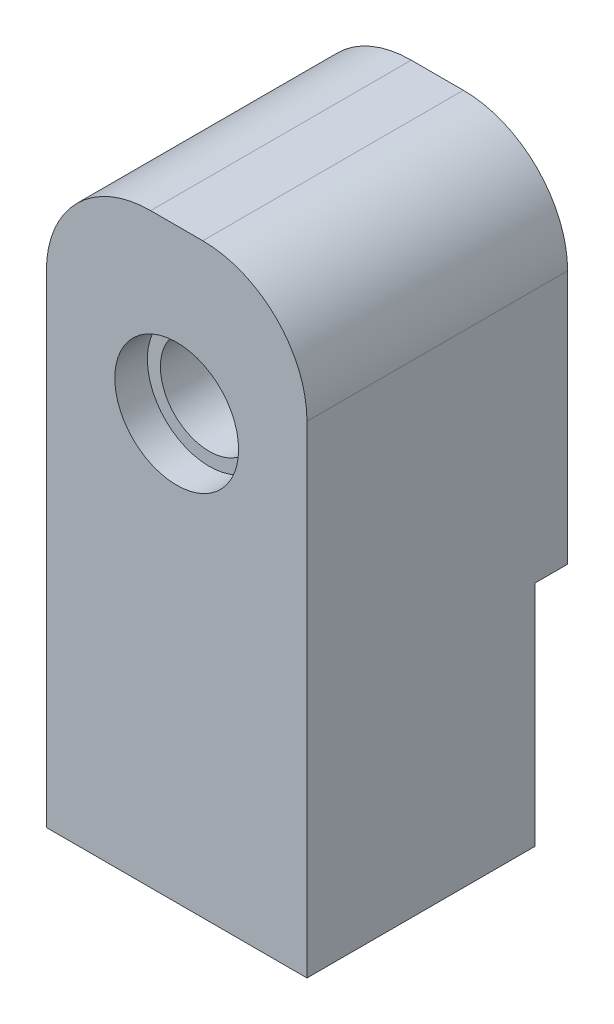
ISO-10303-21;
HEADER;
FILE_DESCRIPTION(('STEP AP214'),'2;1');
FILE_NAME('part.step','',(''),(''),'','','');
FILE_SCHEMA(('AUTOMOTIVE_DESIGN { 1 0 10303 214 1 1 1 1 }'));
ENDSEC;
DATA;
#1=APPLICATION_CONTEXT('core data for automotive mechanical design processes');
#2=APPLICATION_PROTOCOL_DEFINITION('international standard','automotive_design',2000,#1);
#3=PRODUCT_CONTEXT('',#1,'mechanical');
#4=PRODUCT('Part','Part','',(#3));
#5=PRODUCT_RELATED_PRODUCT_CATEGORY('part','',(#4));
#6=PRODUCT_DEFINITION_FORMATION('','',#4);
#7=PRODUCT_DEFINITION_CONTEXT('part definition',#1,'design');
#8=PRODUCT_DEFINITION('design','',#6,#7);
#9=PRODUCT_DEFINITION_SHAPE('','',#8);
#10=(LENGTH_UNIT() NAMED_UNIT(*) SI_UNIT(.MILLI.,.METRE.));
#11=(NAMED_UNIT(*) PLANE_ANGLE_UNIT() SI_UNIT($,.RADIAN.));
#12=(NAMED_UNIT(*) SI_UNIT($,.STERADIAN.) SOLID_ANGLE_UNIT());
#13=UNCERTAINTY_MEASURE_WITH_UNIT(LENGTH_MEASURE(1.E-05),#10,'distance_accuracy_value','');
#14=(GEOMETRIC_REPRESENTATION_CONTEXT(3) GLOBAL_UNCERTAINTY_ASSIGNED_CONTEXT((#13)) GLOBAL_UNIT_ASSIGNED_CONTEXT((#10,
#11,#12)) REPRESENTATION_CONTEXT('',''));
#15=CARTESIAN_POINT('',(0.,0.,0.));
#16=DIRECTION('',(0.,0.,1.));
#17=DIRECTION('',(1.,0.,0.));
#18=AXIS2_PLACEMENT_3D('',#15,#16,#17);
#19=CARTESIAN_POINT('',(12.7,-28.575,-25.4));
#20=DIRECTION('',(0.,-1.,0.));
#21=DIRECTION('',(0.,0.,-1.));
#22=AXIS2_PLACEMENT_3D('',#19,#20,#21);
#23=PLANE('',#22);
#24=CARTESIAN_POINT('',(0.,-28.575,-12.7));
#25=DIRECTION('',(0.,-1.,0.));
#26=DIRECTION('',(0.,0.,-1.));
#27=AXIS2_PLACEMENT_3D('',#24,#25,#26);
#28=CIRCLE('',#27,6.35);
#29=CARTESIAN_POINT('',(0.,-28.575,-19.05));
#30=VERTEX_POINT('',#29);
#31=EDGE_CURVE('E278',#30,#30,#28,.T.);
#32=ORIENTED_EDGE('',*,*,#31,.F.);
#33=EDGE_LOOP('',(#32));
#34=FACE_BOUND('',#33,.T.);
#35=DIRECTION('',(0.,0.,1.));
#36=VECTOR('',#35,1.);
#37=CARTESIAN_POINT('',(-12.7,-28.575,-25.4));
#38=LINE('',#37,#36);
#39=CARTESIAN_POINT('',(-12.7,-28.575,-22.225));
#40=VERTEX_POINT('',#39);
#41=CARTESIAN_POINT('',(-12.7,-28.575,0.));
#42=VERTEX_POINT('',#41);
#43=EDGE_CURVE('E171',#40,#42,#38,.T.);
#44=ORIENTED_EDGE('',*,*,#43,.F.);
#45=DIRECTION('',(1.,0.,0.));
#46=VECTOR('',#45,1.);
#47=CARTESIAN_POINT('',(-12.7,-28.575,-22.225));
#48=LINE('',#47,#46);
#49=CARTESIAN_POINT('',(12.7,-28.575,-22.225));
#50=VERTEX_POINT('',#49);
#51=EDGE_CURVE('E128',#40,#50,#48,.T.);
#52=ORIENTED_EDGE('',*,*,#51,.T.);
#53=DIRECTION('',(0.,0.,1.));
#54=VECTOR('',#53,1.);
#55=CARTESIAN_POINT('',(12.7,-28.575,-25.4));
#56=LINE('',#55,#54);
#57=CARTESIAN_POINT('',(12.7,-28.575,0.));
#58=VERTEX_POINT('',#57);
#59=EDGE_CURVE('E185',#50,#58,#56,.T.);
#60=ORIENTED_EDGE('',*,*,#59,.T.);
#61=DIRECTION('',(1.,0.,0.));
#62=VECTOR('',#61,1.);
#63=CARTESIAN_POINT('',(12.7,-28.575,0.));
#64=LINE('',#63,#62);
#65=EDGE_CURVE('E174',#42,#58,#64,.T.);
#66=ORIENTED_EDGE('',*,*,#65,.F.);
#67=EDGE_LOOP('',(#44,#52,#60,#66));
#68=FACE_BOUND('',#67,.T.);
#69=ADVANCED_FACE('F42',(#34,#68),#23,.T.);
#70=CARTESIAN_POINT('',(-12.7,-28.575,-25.4));
#71=DIRECTION('',(-1.,0.,0.));
#72=DIRECTION('',(0.,0.,1.));
#73=AXIS2_PLACEMENT_3D('',#70,#71,#72);
#74=PLANE('',#73);
#75=DIRECTION('',(0.,-1.,0.));
#76=VECTOR('',#75,1.);
#77=CARTESIAN_POINT('',(-12.7,-28.575,0.));
#78=LINE('',#77,#76);
#79=CARTESIAN_POINT('',(-12.7,18.415,0.));
#80=VERTEX_POINT('',#79);
#81=EDGE_CURVE('E157',#80,#42,#78,.T.);
#82=ORIENTED_EDGE('',*,*,#81,.F.);
#83=DIRECTION('',(0.,0.,1.));
#84=VECTOR('',#83,1.);
#85=CARTESIAN_POINT('',(-12.7,18.415,-25.4));
#86=LINE('',#85,#84);
#87=CARTESIAN_POINT('',(-12.7,18.415,-25.4));
#88=VERTEX_POINT('',#87);
#89=EDGE_CURVE('E66',#80,#88,#86,.F.);
#90=ORIENTED_EDGE('',*,*,#89,.T.);
#91=DIRECTION('',(0.,-1.,0.));
#92=VECTOR('',#91,1.);
#93=CARTESIAN_POINT('',(-12.7,-28.575,-25.4));
#94=LINE('',#93,#92);
#95=CARTESIAN_POINT('',(-12.7,-6.35000000000001,-25.4));
#96=VERTEX_POINT('',#95);
#97=EDGE_CURVE('E135',#88,#96,#94,.T.);
#98=ORIENTED_EDGE('',*,*,#97,.T.);
#99=DIRECTION('',(0.,0.,-1.));
#100=VECTOR('',#99,1.);
#101=CARTESIAN_POINT('',(-12.7,-6.35000000000001,-22.225));
#102=LINE('',#101,#100);
#103=CARTESIAN_POINT('',(-12.7,-6.35000000000001,-22.225));
#104=VERTEX_POINT('',#103);
#105=EDGE_CURVE('E115',#104,#96,#102,.T.);
#106=ORIENTED_EDGE('',*,*,#105,.F.);
#107=DIRECTION('',(0.,1.,0.));
#108=VECTOR('',#107,1.);
#109=CARTESIAN_POINT('',(-12.7,-28.575,-22.225));
#110=LINE('',#109,#108);
#111=EDGE_CURVE('E123',#40,#104,#110,.T.);
#112=ORIENTED_EDGE('',*,*,#111,.F.);
#113=ORIENTED_EDGE('',*,*,#43,.T.);
#114=EDGE_LOOP('',(#82,#90,#98,#106,#112,#113));
#115=FACE_BOUND('',#114,.T.);
#116=ADVANCED_FACE('F134',(#115),#74,.T.);
#117=CARTESIAN_POINT('',(12.7,28.575,-25.4));
#118=DIRECTION('',(0.,1.,0.));
#119=DIRECTION('',(0.,0.,1.));
#120=AXIS2_PLACEMENT_3D('',#117,#118,#119);
#121=PLANE('',#120);
#122=DIRECTION('',(-1.,0.,0.));
#123=VECTOR('',#122,1.);
#124=CARTESIAN_POINT('',(12.7,28.575,-25.4));
#125=LINE('',#124,#123);
#126=CARTESIAN_POINT('',(2.54,28.575,-25.4));
#127=VERTEX_POINT('',#126);
#128=CARTESIAN_POINT('',(-2.54,28.575,-25.4));
#129=VERTEX_POINT('',#128);
#130=EDGE_CURVE('E167',#127,#129,#125,.T.);
#131=ORIENTED_EDGE('',*,*,#130,.T.);
#132=DIRECTION('',(0.,0.,1.));
#133=VECTOR('',#132,1.);
#134=CARTESIAN_POINT('',(-2.54,28.575,-25.4));
#135=LINE('',#134,#133);
#136=CARTESIAN_POINT('',(-2.54,28.575,0.));
#137=VERTEX_POINT('',#136);
#138=EDGE_CURVE('E193',#129,#137,#135,.T.);
#139=ORIENTED_EDGE('',*,*,#138,.T.);
#140=DIRECTION('',(-1.,0.,0.));
#141=VECTOR('',#140,1.);
#142=CARTESIAN_POINT('',(12.7,28.575,0.));
#143=LINE('',#142,#141);
#144=CARTESIAN_POINT('',(2.54,28.575,0.));
#145=VERTEX_POINT('',#144);
#146=EDGE_CURVE('E164',#145,#137,#143,.T.);
#147=ORIENTED_EDGE('',*,*,#146,.F.);
#148=DIRECTION('',(0.,0.,1.));
#149=VECTOR('',#148,1.);
#150=CARTESIAN_POINT('',(2.54,28.575,-25.4));
#151=LINE('',#150,#149);
#152=EDGE_CURVE('E188',#145,#127,#151,.F.);
#153=ORIENTED_EDGE('',*,*,#152,.T.);
#154=EDGE_LOOP('',(#131,#139,#147,#153));
#155=FACE_BOUND('',#154,.T.);
#156=ADVANCED_FACE('F212',(#155),#121,.T.);
#157=CARTESIAN_POINT('',(12.7,-28.575,-25.4));
#158=DIRECTION('',(1.,0.,0.));
#159=DIRECTION('',(0.,0.,-1.));
#160=AXIS2_PLACEMENT_3D('',#157,#158,#159);
#161=PLANE('',#160);
#162=DIRECTION('',(0.,1.,0.));
#163=VECTOR('',#162,1.);
#164=CARTESIAN_POINT('',(12.7,-28.575,-25.4));
#165=LINE('',#164,#163);
#166=CARTESIAN_POINT('',(12.7,-6.35000000000001,-25.4));
#167=VERTEX_POINT('',#166);
#168=CARTESIAN_POINT('',(12.7,18.415,-25.4));
#169=VERTEX_POINT('',#168);
#170=EDGE_CURVE('E163',#167,#169,#165,.T.);
#171=ORIENTED_EDGE('',*,*,#170,.T.);
#172=DIRECTION('',(0.,0.,1.));
#173=VECTOR('',#172,1.);
#174=CARTESIAN_POINT('',(12.7,18.415,-25.4));
#175=LINE('',#174,#173);
#176=CARTESIAN_POINT('',(12.7,18.415,0.));
#177=VERTEX_POINT('',#176);
#178=EDGE_CURVE('E11',#169,#177,#175,.T.);
#179=ORIENTED_EDGE('',*,*,#178,.T.);
#180=DIRECTION('',(0.,1.,0.));
#181=VECTOR('',#180,1.);
#182=CARTESIAN_POINT('',(12.7,-28.575,0.));
#183=LINE('',#182,#181);
#184=EDGE_CURVE('E178',#58,#177,#183,.T.);
#185=ORIENTED_EDGE('',*,*,#184,.F.);
#186=ORIENTED_EDGE('',*,*,#59,.F.);
#187=DIRECTION('',(0.,1.,0.));
#188=VECTOR('',#187,1.);
#189=CARTESIAN_POINT('',(12.7,-28.575,-22.225));
#190=LINE('',#189,#188);
#191=CARTESIAN_POINT('',(12.7,-6.35000000000001,-22.225));
#192=VERTEX_POINT('',#191);
#193=EDGE_CURVE('E122',#50,#192,#190,.T.);
#194=ORIENTED_EDGE('',*,*,#193,.T.);
#195=DIRECTION('',(0.,0.,-1.));
#196=VECTOR('',#195,1.);
#197=CARTESIAN_POINT('',(12.7,-6.35000000000001,-22.225));
#198=LINE('',#197,#196);
#199=EDGE_CURVE('E118',#192,#167,#198,.T.);
#200=ORIENTED_EDGE('',*,*,#199,.T.);
#201=EDGE_LOOP('',(#171,#179,#185,#186,#194,#200));
#202=FACE_BOUND('',#201,.T.);
#203=ADVANCED_FACE('F223',(#202),#161,.T.);
#204=CARTESIAN_POINT('',(0.,0.,-25.4));
#205=DIRECTION('',(0.,0.,1.));
#206=DIRECTION('',(1.,0.,0.));
#207=AXIS2_PLACEMENT_3D('',#204,#205,#206);
#208=PLANE('',#207);
#209=CARTESIAN_POINT('',(0.,12.7,-25.4));
#210=DIRECTION('',(0.,0.,-1.));
#211=DIRECTION('',(-1.,0.,0.));
#212=AXIS2_PLACEMENT_3D('',#209,#210,#211);
#213=CIRCLE('',#212,4.7625);
#214=CARTESIAN_POINT('',(-4.7625,12.7,-25.4));
#215=VERTEX_POINT('',#214);
#216=EDGE_CURVE('E145',#215,#215,#213,.T.);
#217=ORIENTED_EDGE('',*,*,#216,.F.);
#218=EDGE_LOOP('',(#217));
#219=FACE_BOUND('',#218,.T.);
#220=ORIENTED_EDGE('',*,*,#97,.F.);
#221=CARTESIAN_POINT('',(-2.54,18.415,-25.4));
#222=DIRECTION('',(0.,0.,1.));
#223=DIRECTION('',(1.,0.,0.));
#224=AXIS2_PLACEMENT_3D('',#221,#222,#223);
#225=CIRCLE('',#224,10.16);
#226=EDGE_CURVE('E51',#88,#129,#225,.F.);
#227=ORIENTED_EDGE('',*,*,#226,.T.);
#228=ORIENTED_EDGE('',*,*,#130,.F.);
#229=CARTESIAN_POINT('',(2.54,18.415,-25.4));
#230=DIRECTION('',(0.,0.,1.));
#231=DIRECTION('',(1.,0.,0.));
#232=AXIS2_PLACEMENT_3D('',#229,#230,#231);
#233=CIRCLE('',#232,10.16);
#234=EDGE_CURVE('E58',#127,#169,#233,.F.);
#235=ORIENTED_EDGE('',*,*,#234,.T.);
#236=ORIENTED_EDGE('',*,*,#170,.F.);
#237=DIRECTION('',(1.,0.,0.));
#238=VECTOR('',#237,1.);
#239=CARTESIAN_POINT('',(-12.7,-6.35000000000001,-25.4));
#240=LINE('',#239,#238);
#241=EDGE_CURVE('E132',#96,#167,#240,.T.);
#242=ORIENTED_EDGE('',*,*,#241,.F.);
#243=EDGE_LOOP('',(#220,#227,#228,#235,#236,#242));
#244=FACE_BOUND('',#243,.T.);
#245=ADVANCED_FACE('F208',(#219,#244),#208,.F.);
#246=CARTESIAN_POINT('',(0.,0.,0.));
#247=DIRECTION('',(0.,0.,1.));
#248=DIRECTION('',(1.,0.,0.));
#249=AXIS2_PLACEMENT_3D('',#246,#247,#248);
#250=PLANE('',#249);
#251=CARTESIAN_POINT('',(0.,12.7,0.));
#252=DIRECTION('',(0.,0.,1.));
#253=DIRECTION('',(1.,0.,0.));
#254=AXIS2_PLACEMENT_3D('',#251,#252,#253);
#255=CIRCLE('',#254,6.0325);
#256=CARTESIAN_POINT('',(6.0325,12.7,0.));
#257=VERTEX_POINT('',#256);
#258=EDGE_CURVE('E149',#257,#257,#255,.T.);
#259=ORIENTED_EDGE('',*,*,#258,.F.);
#260=EDGE_LOOP('',(#259));
#261=FACE_BOUND('',#260,.T.);
#262=ORIENTED_EDGE('',*,*,#146,.T.);
#263=CARTESIAN_POINT('',(-2.54,18.415,0.));
#264=DIRECTION('',(0.,0.,1.));
#265=DIRECTION('',(1.,0.,0.));
#266=AXIS2_PLACEMENT_3D('',#263,#264,#265);
#267=CIRCLE('',#266,10.16);
#268=EDGE_CURVE('E200',#137,#80,#267,.T.);
#269=ORIENTED_EDGE('',*,*,#268,.T.);
#270=ORIENTED_EDGE('',*,*,#81,.T.);
#271=ORIENTED_EDGE('',*,*,#65,.T.);
#272=ORIENTED_EDGE('',*,*,#184,.T.);
#273=CARTESIAN_POINT('',(2.54,18.415,0.));
#274=DIRECTION('',(0.,0.,1.));
#275=DIRECTION('',(1.,0.,0.));
#276=AXIS2_PLACEMENT_3D('',#273,#274,#275);
#277=CIRCLE('',#276,10.16);
#278=EDGE_CURVE('E197',#177,#145,#277,.T.);
#279=ORIENTED_EDGE('',*,*,#278,.T.);
#280=EDGE_LOOP('',(#262,#269,#270,#271,#272,#279));
#281=FACE_BOUND('',#280,.T.);
#282=ADVANCED_FACE('F217',(#261,#281),#250,.T.);
#283=CARTESIAN_POINT('',(0.,12.7,-3.175));
#284=DIRECTION('',(0.,0.,1.));
#285=DIRECTION('',(1.,0.,0.));
#286=AXIS2_PLACEMENT_3D('',#283,#284,#285);
#287=CYLINDRICAL_SURFACE('',#286,6.0325);
#288=CARTESIAN_POINT('',(0.,12.7,-3.175));
#289=DIRECTION('',(0.,0.,1.));
#290=DIRECTION('',(1.,0.,0.));
#291=AXIS2_PLACEMENT_3D('',#288,#289,#290);
#292=CIRCLE('',#291,6.0325);
#293=CARTESIAN_POINT('',(6.0325,12.7,-3.175));
#294=VERTEX_POINT('',#293);
#295=EDGE_CURVE('E153',#294,#294,#292,.T.);
#296=ORIENTED_EDGE('',*,*,#295,.F.);
#297=EDGE_LOOP('',(#296));
#298=FACE_BOUND('',#297,.T.);
#299=ORIENTED_EDGE('',*,*,#258,.T.);
#300=EDGE_LOOP('',(#299));
#301=FACE_BOUND('',#300,.T.);
#302=ADVANCED_FACE('F246',(#298,#301),#287,.F.);
#303=CARTESIAN_POINT('',(0.,12.7,-3.175));
#304=DIRECTION('',(0.,0.,1.));
#305=DIRECTION('',(1.,0.,0.));
#306=AXIS2_PLACEMENT_3D('',#303,#304,#305);
#307=PLANE('',#306);
#308=CARTESIAN_POINT('',(0.,12.7,-3.175));
#309=DIRECTION('',(0.,0.,1.));
#310=DIRECTION('',(1.,0.,0.));
#311=AXIS2_PLACEMENT_3D('',#308,#309,#310);
#312=CIRCLE('',#311,4.7625);
#313=CARTESIAN_POINT('',(4.7625,12.7,-3.175));
#314=VERTEX_POINT('',#313);
#315=EDGE_CURVE('E140',#314,#314,#312,.F.);
#316=ORIENTED_EDGE('',*,*,#315,.T.);
#317=EDGE_LOOP('',(#316));
#318=FACE_BOUND('',#317,.T.);
#319=ORIENTED_EDGE('',*,*,#295,.T.);
#320=EDGE_LOOP('',(#319));
#321=FACE_BOUND('',#320,.T.);
#322=ADVANCED_FACE('F253',(#318,#321),#307,.T.);
#323=CARTESIAN_POINT('',(0.,12.7,0.001000000000001));
#324=DIRECTION('',(0.,0.,-1.));
#325=DIRECTION('',(-1.,0.,0.));
#326=AXIS2_PLACEMENT_3D('',#323,#324,#325);
#327=CYLINDRICAL_SURFACE('',#326,4.7625);
#328=ORIENTED_EDGE('',*,*,#315,.F.);
#329=EDGE_LOOP('',(#328));
#330=FACE_BOUND('',#329,.T.);
#331=ORIENTED_EDGE('',*,*,#216,.T.);
#332=EDGE_LOOP('',(#331));
#333=FACE_BOUND('',#332,.T.);
#334=ADVANCED_FACE('F257',(#330,#333),#327,.F.);
#335=CARTESIAN_POINT('',(-12.7,-6.35000000000001,-22.225));
#336=DIRECTION('',(0.,1.,0.));
#337=DIRECTION('',(-1.,0.,0.));
#338=AXIS2_PLACEMENT_3D('',#335,#336,#337);
#339=PLANE('',#338);
#340=ORIENTED_EDGE('',*,*,#241,.T.);
#341=ORIENTED_EDGE('',*,*,#199,.F.);
#342=DIRECTION('',(1.,0.,0.));
#343=VECTOR('',#342,1.);
#344=CARTESIAN_POINT('',(-12.7,-6.35000000000001,-22.225));
#345=LINE('',#344,#343);
#346=EDGE_CURVE('E111',#104,#192,#345,.T.);
#347=ORIENTED_EDGE('',*,*,#346,.F.);
#348=ORIENTED_EDGE('',*,*,#105,.T.);
#349=EDGE_LOOP('',(#340,#341,#347,#348));
#350=FACE_BOUND('',#349,.T.);
#351=ADVANCED_FACE('F113',(#350),#339,.F.);
#352=CARTESIAN_POINT('',(0.,0.,-22.225));
#353=DIRECTION('',(0.,0.,-1.));
#354=DIRECTION('',(-1.,0.,0.));
#355=AXIS2_PLACEMENT_3D('',#352,#353,#354);
#356=PLANE('',#355);
#357=ORIENTED_EDGE('',*,*,#111,.T.);
#358=ORIENTED_EDGE('',*,*,#346,.T.);
#359=ORIENTED_EDGE('',*,*,#193,.F.);
#360=ORIENTED_EDGE('',*,*,#51,.F.);
#361=EDGE_LOOP('',(#357,#358,#359,#360));
#362=FACE_BOUND('',#361,.T.);
#363=ADVANCED_FACE('F126',(#362),#356,.T.);
#364=CARTESIAN_POINT('',(0.,1.60019999999999,-12.7));
#365=DIRECTION('',(0.,-1.,0.));
#366=DIRECTION('',(0.,0.,-1.));
#367=AXIS2_PLACEMENT_3D('',#364,#365,#366);
#368=CYLINDRICAL_SURFACE('',#367,6.35);
#369=CARTESIAN_POINT('',(0.,1.60019999999999,-12.7));
#370=DIRECTION('',(0.,-1.,0.));
#371=DIRECTION('',(0.,0.,-1.));
#372=AXIS2_PLACEMENT_3D('',#369,#370,#371);
#373=CIRCLE('',#372,6.35);
#374=CARTESIAN_POINT('',(0.,1.60019999999999,-19.05));
#375=VERTEX_POINT('',#374);
#376=EDGE_CURVE('E276',#375,#375,#373,.T.);
#377=ORIENTED_EDGE('',*,*,#376,.F.);
#378=EDGE_LOOP('',(#377));
#379=FACE_BOUND('',#378,.T.);
#380=ORIENTED_EDGE('',*,*,#31,.T.);
#381=EDGE_LOOP('',(#380));
#382=FACE_BOUND('',#381,.T.);
#383=ADVANCED_FACE('F266',(#379,#382),#368,.F.);
#384=CARTESIAN_POINT('',(0.,1.60019999999999,-12.7));
#385=DIRECTION('',(0.,-1.,0.));
#386=DIRECTION('',(0.,0.,-1.));
#387=AXIS2_PLACEMENT_3D('',#384,#385,#386);
#388=PLANE('',#387);
#389=ORIENTED_EDGE('',*,*,#376,.T.);
#390=EDGE_LOOP('',(#389));
#391=FACE_BOUND('',#390,.T.);
#392=ADVANCED_FACE('F230',(#391),#388,.T.);
#393=CARTESIAN_POINT('',(-2.54,18.415,-25.4));
#394=DIRECTION('',(0.,0.,1.));
#395=DIRECTION('',(1.,0.,0.));
#396=AXIS2_PLACEMENT_3D('',#393,#394,#395);
#397=CYLINDRICAL_SURFACE('',#396,10.16);
#398=ORIENTED_EDGE('',*,*,#226,.F.);
#399=ORIENTED_EDGE('',*,*,#89,.F.);
#400=ORIENTED_EDGE('',*,*,#268,.F.);
#401=ORIENTED_EDGE('',*,*,#138,.F.);
#402=EDGE_LOOP('',(#398,#399,#400,#401));
#403=FACE_BOUND('',#402,.T.);
#404=ADVANCED_FACE('F215',(#403),#397,.T.);
#405=CARTESIAN_POINT('',(2.54,18.415,-25.4));
#406=DIRECTION('',(0.,0.,1.));
#407=DIRECTION('',(1.,0.,0.));
#408=AXIS2_PLACEMENT_3D('',#405,#406,#407);
#409=CYLINDRICAL_SURFACE('',#408,10.16);
#410=ORIENTED_EDGE('',*,*,#234,.F.);
#411=ORIENTED_EDGE('',*,*,#152,.F.);
#412=ORIENTED_EDGE('',*,*,#278,.F.);
#413=ORIENTED_EDGE('',*,*,#178,.F.);
#414=EDGE_LOOP('',(#410,#411,#412,#413));
#415=FACE_BOUND('',#414,.T.);
#416=ADVANCED_FACE('F44',(#415),#409,.T.);
#417=CLOSED_SHELL('',(#69,#116,#156,#203,#245,#282,#302,#322,#334,#351,#363,#383,#392,#404,#416));
#418=MANIFOLD_SOLID_BREP('B2',#417);
#419=ADVANCED_BREP_SHAPE_REPRESENTATION('',(#18,#418),#14);
#420=SHAPE_DEFINITION_REPRESENTATION(#9,#419);
ENDSEC;
END-ISO-10303-21;
